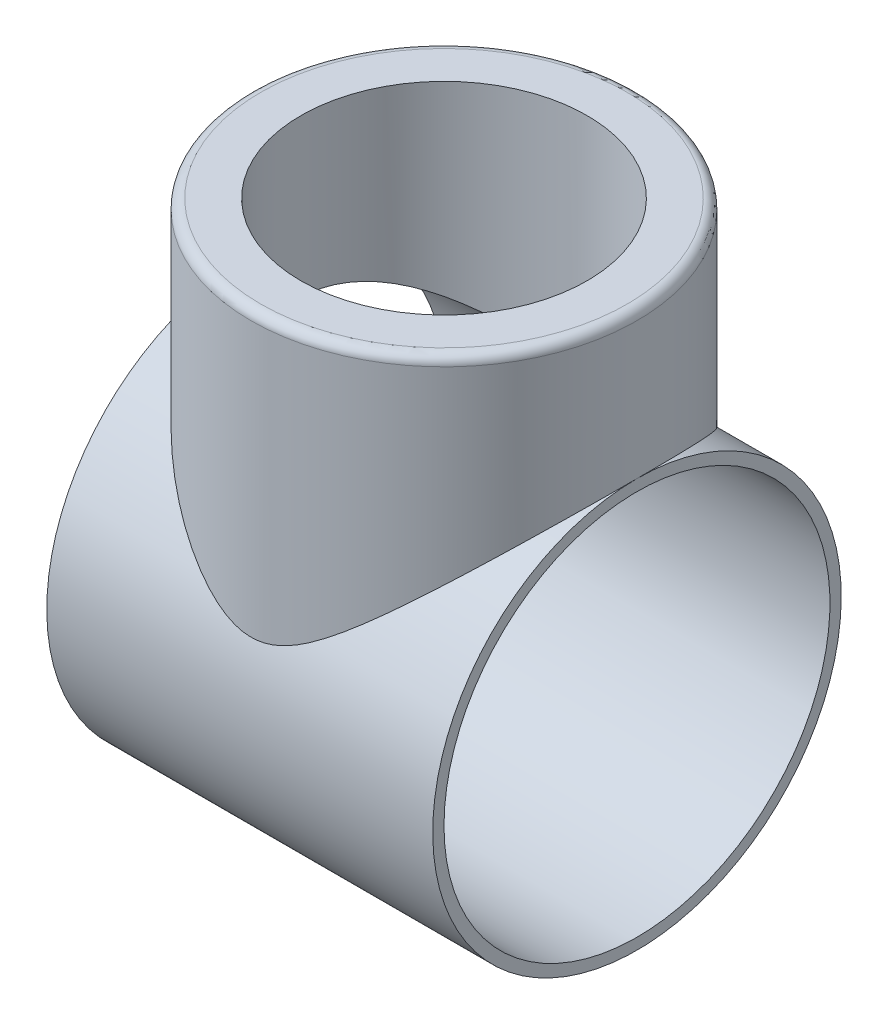
ISO-10303-21;
HEADER;
FILE_DESCRIPTION(('STEP AP214'),'2;1');
FILE_NAME('part.step','',(''),(''),'','','');
FILE_SCHEMA(('AUTOMOTIVE_DESIGN { 1 0 10303 214 1 1 1 1 }'));
ENDSEC;
DATA;
#1=APPLICATION_CONTEXT('core data for automotive mechanical design processes');
#2=APPLICATION_PROTOCOL_DEFINITION('international standard','automotive_design',2000,#1);
#3=PRODUCT_CONTEXT('',#1,'mechanical');
#4=PRODUCT('Part','Part','',(#3));
#5=PRODUCT_RELATED_PRODUCT_CATEGORY('part','',(#4));
#6=PRODUCT_DEFINITION_FORMATION('','',#4);
#7=PRODUCT_DEFINITION_CONTEXT('part definition',#1,'design');
#8=PRODUCT_DEFINITION('design','',#6,#7);
#9=PRODUCT_DEFINITION_SHAPE('','',#8);
#10=(LENGTH_UNIT() NAMED_UNIT(*) SI_UNIT(.MILLI.,.METRE.));
#11=(NAMED_UNIT(*) PLANE_ANGLE_UNIT() SI_UNIT($,.RADIAN.));
#12=(NAMED_UNIT(*) SI_UNIT($,.STERADIAN.) SOLID_ANGLE_UNIT());
#13=UNCERTAINTY_MEASURE_WITH_UNIT(LENGTH_MEASURE(1.E-05),#10,'distance_accuracy_value','');
#14=(GEOMETRIC_REPRESENTATION_CONTEXT(3) GLOBAL_UNCERTAINTY_ASSIGNED_CONTEXT((#13)) GLOBAL_UNIT_ASSIGNED_CONTEXT((#10,
#11,#12)) REPRESENTATION_CONTEXT('',''));
#15=CARTESIAN_POINT('',(0.,0.,0.));
#16=DIRECTION('',(0.,0.,1.));
#17=DIRECTION('',(1.,0.,0.));
#18=AXIS2_PLACEMENT_3D('',#15,#16,#17);
#19=CARTESIAN_POINT('',(60.,0.,0.));
#20=DIRECTION('',(-1.,0.,0.));
#21=DIRECTION('',(0.,0.,1.));
#22=AXIS2_PLACEMENT_3D('',#19,#20,#21);
#23=CYLINDRICAL_SURFACE('',#22,63.5);
#24=CARTESIAN_POINT('',(0.,20.7906228862918,-60.));
#25=CARTESIAN_POINT('',(-0.758528909390593,20.7906687322399,-59.9999904065511));
#26=CARTESIAN_POINT('',(-1.51729366262085,20.8324790088875,-59.98554699321));
#27=CARTESIAN_POINT('',(-3.02541119739764,20.9961734248151,-59.9284381571005));
#28=CARTESIAN_POINT('',(-3.7747547096643,21.1181309601118,-59.8857468656814));
#29=CARTESIAN_POINT('',(-5.26008636130047,21.4333476508569,-59.7736517022794));
#30=CARTESIAN_POINT('',(-5.99598309437329,21.6269798770012,-59.7041079787402));
#31=CARTESIAN_POINT('',(-7.44660432062502,22.0731706531462,-59.5405851678695));
#32=CARTESIAN_POINT('',(-8.16132786930634,22.3257318274139,-59.4466049922948));
#33=CARTESIAN_POINT('',(-9.4185024288943,22.8188288099899,-59.2587975120337));
#34=CARTESIAN_POINT('',(-9.96516431764429,23.0504265040595,-59.1692185698772));
#35=CARTESIAN_POINT('',(-11.0454442017346,23.5376156349974,-58.9771073554713));
#36=CARTESIAN_POINT('',(-11.5790596845841,23.793211648322,-58.8745726112687));
#37=CARTESIAN_POINT('',(-12.6342055594526,24.3241678903389,-58.6572009071734));
#38=CARTESIAN_POINT('',(-13.1557274926232,24.5995414317841,-58.5423556346522));
#39=CARTESIAN_POINT('',(-14.1871816507752,25.1662568681659,-58.3009810156804));
#40=CARTESIAN_POINT('',(-14.6971145190673,25.4575978736686,-58.1744523197619));
#41=CARTESIAN_POINT('',(-15.7078218450643,26.0541498508794,-57.9097406057808));
#42=CARTESIAN_POINT('',(-16.2085648488496,26.3593992025115,-57.7715243095543));
#43=CARTESIAN_POINT('',(-17.2002231418555,26.980521261027,-57.4840737539756));
#44=CARTESIAN_POINT('',(-17.6911376592914,27.2963947969985,-57.3348386336471));
#45=CARTESIAN_POINT('',(-19.1499499190291,28.2565531409301,-56.8710945910735));
#46=CARTESIAN_POINT('',(-20.1043443165855,28.9136328016263,-56.5404340934387));
#47=CARTESIAN_POINT('',(-22.0039769964669,30.2649996523406,-55.8290004142343));
#48=CARTESIAN_POINT('',(-22.9484730965435,30.9597983411099,-55.4472322243461));
#49=CARTESIAN_POINT('',(-24.8087273501631,32.3627900030287,-54.640232118589));
#50=CARTESIAN_POINT('',(-25.7244808693601,33.0709851069629,-54.2149932402454));
#51=CARTESIAN_POINT('',(-27.5301587030445,34.4942177445593,-53.3207838963083));
#52=CARTESIAN_POINT('',(-28.4200632243271,35.2092599917402,-52.8517810198543));
#53=CARTESIAN_POINT('',(-30.1746375527394,36.6401586498467,-51.8700459354968));
#54=CARTESIAN_POINT('',(-31.0393088329444,37.3560150107007,-51.3573162871723));
#55=CARTESIAN_POINT('',(-32.7428121268253,38.7830613774666,-50.2883478998282));
#56=CARTESIAN_POINT('',(-33.5816780939988,39.4942564530127,-49.7321700686894));
#57=CARTESIAN_POINT('',(-35.2346699825341,40.9090380230505,-48.5750536608696));
#58=CARTESIAN_POINT('',(-36.0487951337687,41.6126242802584,-47.9741136928473));
#59=CARTESIAN_POINT('',(-37.6510954118819,43.0081407004995,-46.7271330486956));
#60=CARTESIAN_POINT('',(-38.4392848277944,43.7000771756526,-46.0811178399591));
#61=CARTESIAN_POINT('',(-39.9888399141275,45.0691221589827,-44.7430488200408));
#62=CARTESIAN_POINT('',(-40.7502076319229,45.7462317974337,-44.0509985345428));
#63=CARTESIAN_POINT('',(-42.582920452239,47.3847886646906,-42.2960309164036));
#64=CARTESIAN_POINT('',(-43.6385274405875,48.3361625708875,-41.2070707142414));
#65=CARTESIAN_POINT('',(-45.6828552063846,50.1895163052427,-38.9283808789139));
#66=CARTESIAN_POINT('',(-46.6715760592438,51.0914961890899,-37.7386513593641));
#67=CARTESIAN_POINT('',(-48.0968489136663,52.397719369308,-35.8789928350596));
#68=CARTESIAN_POINT('',(-48.5620560600247,52.8251053584278,-35.2469780635363));
#69=CARTESIAN_POINT('',(-49.4722030615757,53.6629970827709,-33.9576752372916));
#70=CARTESIAN_POINT('',(-49.9171443182551,54.0735039850752,-33.3003889360367));
#71=CARTESIAN_POINT('',(-50.7852396764171,54.8758885887138,-31.9608542168824));
#72=CARTESIAN_POINT('',(-51.2084000426182,55.2677716442079,-31.2786130742795));
#73=CARTESIAN_POINT('',(-52.0316481010739,56.0314086794391,-29.8891272744112));
#74=CARTESIAN_POINT('',(-52.4317299163567,56.4031575305253,-29.1818763216913));
#75=CARTESIAN_POINT('',(-53.4326006917373,57.3344775183045,-27.3244873901495));
#76=CARTESIAN_POINT('',(-54.0148396806077,57.8775849365437,-26.1559284749152));
#77=CARTESIAN_POINT('',(-55.1104563481879,58.9013953354424,-23.7606996871457));
#78=CARTESIAN_POINT('',(-55.623849737572,59.3821125528359,-22.5340431593333));
#79=CARTESIAN_POINT('',(-56.3369569822265,60.0507779860612,-20.6542203035781));
#80=CARTESIAN_POINT('',(-56.5651646691798,60.2649336682026,-20.0209651192068));
#81=CARTESIAN_POINT('',(-57.001741284094,60.6748948739397,-18.7418762661227));
#82=CARTESIAN_POINT('',(-57.2101134658845,60.8707034071312,-18.0960446814612));
#83=CARTESIAN_POINT('',(-57.6062016973035,61.2431214762665,-16.7925461809546));
#84=CARTESIAN_POINT('',(-57.7939157959858,61.4197291988699,-16.1348781540904));
#85=CARTESIAN_POINT('',(-58.1478526247793,61.7528881498504,-14.8087211107725));
#86=CARTESIAN_POINT('',(-58.3140744128745,61.9094384991028,-14.1402316214542));
#87=CARTESIAN_POINT('',(-58.6254299614442,62.2027997497841,-12.7884212341209));
#88=CARTESIAN_POINT('',(-58.7703922744052,62.3394501114345,-12.1050259204838));
#89=CARTESIAN_POINT('',(-59.0369866822571,62.5908445998106,-10.7296289567849));
#90=CARTESIAN_POINT('',(-59.1586165304059,62.7055866169215,-10.037626484743));
#91=CARTESIAN_POINT('',(-59.3778914230342,62.9125001293602,-8.64649196407172));
#92=CARTESIAN_POINT('',(-59.475537005446,63.0046721309006,-7.94736007571117));
#93=CARTESIAN_POINT('',(-59.6463168139495,63.165911038749,-6.54346262801516));
#94=CARTESIAN_POINT('',(-59.7194513133625,63.2349782026975,-5.8386971315894));
#95=CARTESIAN_POINT('',(-59.8407758047187,63.3495702561387,-4.42541956584602));
#96=CARTESIAN_POINT('',(-59.8889765473168,63.3951052919398,-3.71690924452197));
#97=CARTESIAN_POINT('',(-59.9602033516643,63.4623971368019,-2.29757972319874));
#98=CARTESIAN_POINT('',(-59.9832322842367,63.4841566574395,-1.58676079577031));
#99=CARTESIAN_POINT('',(-60.0039892025269,63.5037692257477,-0.164433052004147));
#100=CARTESIAN_POINT('',(-60.0017179853667,63.5016230266065,0.547075741891974));
#101=CARTESIAN_POINT('',(-59.9719010196848,63.4734503428098,1.96902100026202));
#102=CARTESIAN_POINT('',(-59.9443559975306,63.4474245444525,2.679457494966));
#103=CARTESIAN_POINT('',(-59.8337650199722,63.3429462153451,4.63417148601375));
#104=CARTESIAN_POINT('',(-59.7244990534306,63.2397297181741,5.87582573496756));
#105=CARTESIAN_POINT('',(-59.4302796460327,62.9619393948515,8.34172373501795));
#106=CARTESIAN_POINT('',(-59.2453336712804,62.7873726076638,9.56596919122999));
#107=CARTESIAN_POINT('',(-58.8027968147367,62.3699728081123,11.989514771222));
#108=CARTESIAN_POINT('',(-58.5451991013245,62.1271333759116,13.1888125377168));
#109=CARTESIAN_POINT('',(-57.961305301611,61.5772140343237,15.5554813630102));
#110=CARTESIAN_POINT('',(-57.6350054065378,61.2701305633253,16.722850647674));
#111=CARTESIAN_POINT('',(-56.9088702964538,60.5875710834975,19.050065571891));
#112=CARTESIAN_POINT('',(-56.507334178709,60.2105155945908,20.2089148761407));
#113=CARTESIAN_POINT('',(-55.6419501166776,59.3991076301619,22.4822789702302));
#114=CARTESIAN_POINT('',(-55.1781030216677,58.9647559355682,23.5967943640572));
#115=CARTESIAN_POINT('',(-54.1933504392048,58.0442814595975,25.7781503739198));
#116=CARTESIAN_POINT('',(-53.6724420871035,57.5581560790584,26.8449885926275));
#117=CARTESIAN_POINT('',(-52.5785531216232,56.5394950047237,28.9288943388254));
#118=CARTESIAN_POINT('',(-52.0055613586887,56.0069493746984,29.94595113752));
#119=CARTESIAN_POINT('',(-50.9564836787026,55.0343933635614,31.6892273695647));
#120=CARTESIAN_POINT('',(-50.4903989534606,54.6030819626321,32.4263828230759));
#121=CARTESIAN_POINT('',(-49.5330968526136,53.7191212703474,33.870678097755));
#122=CARTESIAN_POINT('',(-49.0418837011452,53.2664755663289,34.5778229274382));
#123=CARTESIAN_POINT('',(-47.5326431796392,51.8791349918499,36.6548496992369));
#124=CARTESIAN_POINT('',(-46.4792485157516,50.915253822379,37.9799383317709));
#125=CARTESIAN_POINT('',(-44.2876354690731,48.9227510920271,40.5144742737073));
#126=CARTESIAN_POINT('',(-43.1491544240427,47.8939307220679,41.7235347598777));
#127=CARTESIAN_POINT('',(-40.799815617742,45.7886694310987,44.0235959738365));
#128=CARTESIAN_POINT('',(-39.5889676055662,44.712234929599,45.1146125487971));
#129=CARTESIAN_POINT('',(-37.5566358288247,42.9256357130061,46.803317434297));
#130=CARTESIAN_POINT('',(-36.7546948944416,42.225483667487,47.4355079174354));
#131=CARTESIAN_POINT('',(-35.1253194151573,40.8150874837224,48.6543643005233));
#132=CARTESIAN_POINT('',(-34.2978833639616,40.1048427505247,49.2410275034114));
#133=CARTESIAN_POINT('',(-32.6175047511009,38.6775738556822,50.3698696624441));
#134=CARTESIAN_POINT('',(-31.7645426975343,37.9605448147292,50.9120133759927));
#135=CARTESIAN_POINT('',(-30.0336692030098,36.5244804865607,51.9518821652084));
#136=CARTESIAN_POINT('',(-29.155758762104,35.8054452808009,52.4496090180162));
#137=CARTESIAN_POINT('',(-27.3763991281174,34.3720787220823,53.3998838019665));
#138=CARTESIAN_POINT('',(-26.4750155378331,33.6577400546386,53.852543505548));
#139=CARTESIAN_POINT('',(-24.6447075201963,32.2378294886631,54.7143663452147));
#140=CARTESIAN_POINT('',(-23.7157797059046,31.532258683524,55.1235241035372));
#141=CARTESIAN_POINT('',(-21.8287917760075,30.1387068647751,55.8976090636547));
#142=CARTESIAN_POINT('',(-20.8707704289992,29.4507045136316,56.2625921516717));
#143=CARTESIAN_POINT('',(-18.9203529914623,28.1021712098136,56.9481250825322));
#144=CARTESIAN_POINT('',(-17.9279688275069,27.4416308974152,57.2686901524572));
#145=CARTESIAN_POINT('',(-16.2347758220798,26.3731023134669,57.7662059172242));
#146=CARTESIAN_POINT('',(-15.5451042326865,25.9533452186927,57.9557727293178));
#147=CARTESIAN_POINT('',(-14.1450009988251,25.1397301303381,58.3133016256247));
#148=CARTESIAN_POINT('',(-13.4345684860103,24.7458732223051,58.4812628045688));
#149=CARTESIAN_POINT('',(-11.9915601861318,23.993105210065,58.794105374896));
#150=CARTESIAN_POINT('',(-11.2590148117499,23.6341487403093,58.9390168877664));
#151=CARTESIAN_POINT('',(-9.76890030891744,22.9617010121501,59.2042300029197));
#152=CARTESIAN_POINT('',(-9.01133819327823,22.6481971428826,59.3245384351665));
#153=CARTESIAN_POINT('',(-7.66394620885365,22.1517197827823,59.5113698196047));
#154=CARTESIAN_POINT('',(-7.079751872073,21.9557353810002,59.583813090906));
#155=CARTESIAN_POINT('',(-5.89778570076967,21.6036089820242,59.7123876813954));
#156=CARTESIAN_POINT('',(-5.30001891891908,21.4474524144445,59.7685249669181));
#157=CARTESIAN_POINT('',(-4.09422584327694,21.1817843970081,59.8631939386489));
#158=CARTESIAN_POINT('',(-3.48622800298982,21.0721605455251,59.9017680659426));
#159=CARTESIAN_POINT('',(-2.26220406470628,20.9045528992181,59.9604675581135));
#160=CARTESIAN_POINT('',(-1.64617858093478,20.846565176788,59.9805943261582));
#161=CARTESIAN_POINT('',(-0.406796236364823,20.7853299263222,60.0018431849288));
#162=CARTESIAN_POINT('',(0.216581931804922,20.782460444376,60.0028340260279));
#163=CARTESIAN_POINT('',(1.46078189065845,20.8326035275547,59.985442278827));
#164=CARTESIAN_POINT('',(2.08160363194154,20.8856171675315,59.9670593178927));
#165=CARTESIAN_POINT('',(3.31671831080057,21.0445852806879,59.9114546959283));
#166=CARTESIAN_POINT('',(3.93099594436183,21.1506440349662,59.8741959251749));
#167=CARTESIAN_POINT('',(5.14799615984711,21.4102311635758,59.7818607643608));
#168=CARTESIAN_POINT('',(5.75071664967074,21.5637680479414,59.7267811799951));
#169=CARTESIAN_POINT('',(7.22135694427497,21.9931303830578,59.5703433546844));
#170=CARTESIAN_POINT('',(8.08135503699847,22.2925568468197,59.459390890244));
#171=CARTESIAN_POINT('',(9.7699223088969,22.9586099987819,59.2053970578337));
#172=CARTESIAN_POINT('',(10.5984702437983,23.3252811683373,59.0623344353738));
#173=CARTESIAN_POINT('',(12.2287783127482,24.1097614729604,58.746479888434));
#174=CARTESIAN_POINT('',(13.0304255363341,24.5277583980893,58.5735777926153));
#175=CARTESIAN_POINT('',(14.6066295614521,25.4002579302589,58.2005340027037));
#176=CARTESIAN_POINT('',(15.3811908052121,25.854754510496,58.000396801882));
#177=CARTESIAN_POINT('',(17.0118428044232,26.8548428987069,57.5448468491374));
#178=CARTESIAN_POINT('',(17.8644479805038,27.404354072206,57.2856174903083));
#179=CARTESIAN_POINT('',(19.5432794738111,28.5271940338681,56.7348277230435));
#180=CARTESIAN_POINT('',(20.3694992682184,29.1005286321143,56.4432593984595));
#181=CARTESIAN_POINT('',(21.9992618422016,30.263702333972,55.8282333428868));
#182=CARTESIAN_POINT('',(22.8027836810339,30.8535557389623,55.5047473265183));
#183=CARTESIAN_POINT('',(24.3886372665537,32.043425198328,54.8264349792147));
#184=CARTESIAN_POINT('',(25.1709707940349,32.6434403917131,54.471611292834));
#185=CARTESIAN_POINT('',(26.717292217867,33.8501069518442,53.730090001806));
#186=CARTESIAN_POINT('',(27.4812507569073,34.4567669411777,53.3433452676083));
#187=CARTESIAN_POINT('',(28.9906404962926,35.6722178063828,52.5383127204356));
#188=CARTESIAN_POINT('',(29.7360714479204,36.2810087107351,52.1200244843194));
#189=CARTESIAN_POINT('',(31.2086452758761,37.4974332369506,51.2518358260863));
#190=CARTESIAN_POINT('',(31.9357955085429,38.1050672303483,50.8019484055167));
#191=CARTESIAN_POINT('',(33.3722766591619,39.3167920231316,49.8700720854739));
#192=CARTESIAN_POINT('',(34.0816073882601,39.9208827849134,49.3880828459778));
#193=CARTESIAN_POINT('',(35.5621292038822,41.1916832002392,48.334788391454));
#194=CARTESIAN_POINT('',(36.3311519208352,41.8576791485037,47.7595654971654));
#195=CARTESIAN_POINT('',(37.8461742604986,43.1792288351406,46.5681837635289));
#196=CARTESIAN_POINT('',(38.592173420413,43.8347823634822,45.9520241020961));
#197=CARTESIAN_POINT('',(40.0603124376435,45.1327034482771,44.6779183477357));
#198=CARTESIAN_POINT('',(40.7824432065482,45.7750659474894,44.0199566101734));
#199=CARTESIAN_POINT('',(42.2010533624282,47.0433627335258,42.6618713423327));
#200=CARTESIAN_POINT('',(42.8975331462099,47.6692972744383,41.9617484647056));
#201=CARTESIAN_POINT('',(44.2609049256131,48.8998143820475,40.521017507327));
#202=CARTESIAN_POINT('',(44.9278811753658,49.5044565887797,39.7805402872029));
#203=CARTESIAN_POINT('',(46.2323436227259,50.6912847640406,38.2567162942636));
#204=CARTESIAN_POINT('',(46.8698286547506,51.2734698448444,37.4733678297129));
#205=CARTESIAN_POINT('',(48.1123681622241,52.4117157514378,35.8640870505328));
#206=CARTESIAN_POINT('',(48.717442060897,52.9677921982709,35.0381808354607));
#207=CARTESIAN_POINT('',(49.8925851930704,54.0506056360253,33.3435603311625));
#208=CARTESIAN_POINT('',(50.462659611206,54.5773469714134,32.4748524168838));
#209=CARTESIAN_POINT('',(51.699934053744,55.7231195826796,30.4764801174487));
#210=CARTESIAN_POINT('',(52.356664408651,56.3331017236957,29.3350678509571));
#211=CARTESIAN_POINT('',(53.6041104557305,57.4943370151524,26.9882327473558));
#212=CARTESIAN_POINT('',(54.1948377861363,58.0456005185766,25.7828212506258));
#213=CARTESIAN_POINT('',(55.3028391398837,59.0814298893704,23.3115648644225));
#214=CARTESIAN_POINT('',(55.8201400017101,59.5660201248309,22.0457422833466));
#215=CARTESIAN_POINT('',(56.7739730326629,60.4607864226878,19.4580612763679));
#216=CARTESIAN_POINT('',(57.2105026371028,60.8709601221679,18.13620107277));
#217=CARTESIAN_POINT('',(57.8007267910454,61.4261308181703,16.1113950707763));
#218=CARTESIAN_POINT('',(57.9874127712146,61.6018391117937,15.4262120958626));
#219=CARTESIAN_POINT('',(58.3374041299347,61.9314075349646,14.044739245825));
#220=CARTESIAN_POINT('',(58.5007123385065,62.0852703090263,13.3484507264558));
#221=CARTESIAN_POINT('',(58.8031402422415,62.3703194822201,11.9459393581315));
#222=CARTESIAN_POINT('',(58.9422563834057,62.5015025495142,11.2397150659803));
#223=CARTESIAN_POINT('',(59.1955130783151,62.740393688889,9.81895124098024));
#224=CARTESIAN_POINT('',(59.3096568654099,62.848104800045,9.10441279725668));
#225=CARTESIAN_POINT('',(59.5122928987245,63.0393677528274,7.66890692232703));
#226=CARTESIAN_POINT('',(59.6007995008431,63.1229331151367,6.94794332303366));
#227=CARTESIAN_POINT('',(59.7517239443748,63.2654558007023,5.50095812532421));
#228=CARTESIAN_POINT('',(59.8141451118529,63.3244162612443,4.77493718376181));
#229=CARTESIAN_POINT('',(59.9125411076332,63.4173660881438,3.3195428430593));
#230=CARTESIAN_POINT('',(59.948517092367,63.4513565464241,2.59016959191732));
#231=CARTESIAN_POINT('',(59.9938077638634,63.4941486592253,1.12987181716054));
#232=CARTESIAN_POINT('',(60.0031233492999,63.5029511627869,0.398947346665709));
#233=CARTESIAN_POINT('',(59.9955648266932,63.4958093154703,-0.967958496529033));
#234=CARTESIAN_POINT('',(59.9819259055394,63.4829219168062,-1.60397782434463));
#235=CARTESIAN_POINT('',(59.9344696401623,63.4380847001962,-2.87464688972434));
#236=CARTESIAN_POINT('',(59.9006505868162,63.4061332676538,-3.50929650671339));
#237=CARTESIAN_POINT('',(59.8129923027163,63.3233277660118,-4.7758532298756));
#238=CARTESIAN_POINT('',(59.7591570784979,63.2724774798005,-5.40776085930742));
#239=CARTESIAN_POINT('',(59.6317156906658,63.1521265361284,-6.66781363904785));
#240=CARTESIAN_POINT('',(59.5581075644902,63.0826240273394,-7.29595840954312));
#241=CARTESIAN_POINT('',(59.3080827836328,62.8466036531324,-9.17297148526001));
#242=CARTESIAN_POINT('',(59.1024447948381,62.6525531478351,-10.4147182262869));
#243=CARTESIAN_POINT('',(58.6167591889884,62.1945973466313,-12.8702342859528));
#244=CARTESIAN_POINT('',(58.3367086016047,61.9306892622204,-14.0840024856697));
#245=CARTESIAN_POINT('',(57.7100015478256,61.3407142955875,-16.4636856187242));
#246=CARTESIAN_POINT('',(57.3641083663048,61.0153600426409,-17.629979120163));
#247=CARTESIAN_POINT('',(56.6085536781709,60.3055684631368,-19.9230807615388));
#248=CARTESIAN_POINT('',(56.1988947678093,59.9211335420844,-21.0498905067879));
#249=CARTESIAN_POINT('',(55.3207434138154,59.0983173899384,-23.2600440438989));
#250=CARTESIAN_POINT('',(54.8522455668946,58.6599312044746,-24.3433838317628));
#251=CARTESIAN_POINT('',(53.8612856691139,57.7343636462476,-26.4637822601105));
#252=CARTESIAN_POINT('',(53.3388122451557,57.2471719904282,-27.5008310805132));
#253=CARTESIAN_POINT('',(52.3889698406636,56.3633957674971,-29.2594364245282));
#254=CARTESIAN_POINT('',(51.9728151953929,55.9767610641627,-29.9921232903098));
#255=CARTESIAN_POINT('',(51.1157596421067,55.1819284837637,-31.4305576832215));
#256=CARTESIAN_POINT('',(50.6748631796574,54.7737344812064,-32.1363100118582));
#257=CARTESIAN_POINT('',(49.3170999662078,53.5192123515484,-34.2134573931227));
#258=CARTESIAN_POINT('',(48.365333821438,52.6431066845712,-35.544422271004));
#259=CARTESIAN_POINT('',(46.3788184091041,50.8240590270626,-38.1003035628411));
#260=CARTESIAN_POINT('',(45.3438610810191,49.880950191552,-39.3249370792602));
#261=CARTESIAN_POINT('',(43.2027194272394,47.9428552948351,-41.6658221487646));
#262=CARTESIAN_POINT('',(42.0965390556093,46.947872114101,-42.7820797099057));
#263=CARTESIAN_POINT('',(40.2064302868388,45.2624736428015,-44.5477544674519));
#264=CARTESIAN_POINT('',(39.4403564109536,44.5831323145074,-45.2271663401913));
#265=CARTESIAN_POINT('',(37.881847787335,43.2105078996867,-46.5403482710392));
#266=CARTESIAN_POINT('',(37.0894112467148,42.5172238662102,-47.1741152155873));
#267=CARTESIAN_POINT('',(35.4789521738248,41.1198933091534,-48.3969715779152));
#268=CARTESIAN_POINT('',(34.6609153926954,40.4158409075946,-48.9860354664779));
#269=CARTESIAN_POINT('',(33.0003075284587,39.0010407184266,-50.1197610987062));
#270=CARTESIAN_POINT('',(32.1577372210999,38.2902931429982,-50.6644242442557));
#271=CARTESIAN_POINT('',(30.4490729831919,36.8669598937637,-51.7093385919693));
#272=CARTESIAN_POINT('',(29.5830080569936,36.1543773886613,-52.2096415656976));
#273=CARTESIAN_POINT('',(27.8256581519399,34.7311285759401,-53.1670401249723));
#274=CARTESIAN_POINT('',(26.9343714604259,34.0204624020541,-53.6241327671729));
#275=CARTESIAN_POINT('',(25.1258248252375,32.6073398840304,-54.4949495594718));
#276=CARTESIAN_POINT('',(24.2085864568005,31.9048773685258,-54.9087084637163));
#277=CARTESIAN_POINT('',(22.344975564338,30.5149443004884,-55.6931263449375));
#278=CARTESIAN_POINT('',(21.3986087449945,29.8274708569014,-56.0637936941325));
#279=CARTESIAN_POINT('',(19.6756130564587,28.6196883457188,-56.6879471908933));
#280=CARTESIAN_POINT('',(18.9052559185584,28.0946895717879,-56.9496640726385));
#281=CARTESIAN_POINT('',(17.341021107444,27.0668241712747,-57.4452982374672));
#282=CARTESIAN_POINT('',(16.5471427806282,26.5639581606797,-57.6792147471333));
#283=CARTESIAN_POINT('',(14.933113310896,25.5897236238591,-58.1179936672118));
#284=CARTESIAN_POINT('',(14.1129804471928,25.1183338593668,-58.3228757752122));
#285=CARTESIAN_POINT('',(12.4422523256131,24.2190798118308,-58.7019917209436));
#286=CARTESIAN_POINT('',(11.5916668925529,23.7912016588509,-58.8762353381179));
#287=CARTESIAN_POINT('',(10.1079983535897,23.1110901117272,-59.1457542845923));
#288=CARTESIAN_POINT('',(9.48330374745795,22.8438858827683,-59.2492821337488));
#289=CARTESIAN_POINT('',(8.21602229594292,22.3475529356675,-59.4382650546879));
#290=CARTESIAN_POINT('',(7.57343358899561,22.1184281964295,-59.5237182381131));
#291=CARTESIAN_POINT('',(6.27313840663821,21.7076776101192,-59.6747400129474));
#292=CARTESIAN_POINT('',(5.61548874890345,21.5258976752117,-59.7403732243001));
#293=CARTESIAN_POINT('',(4.2857853782639,21.2179349544761,-59.850449047694));
#294=CARTESIAN_POINT('',(3.61374296616364,21.0917101136825,-59.894907690893));
#295=CARTESIAN_POINT('',(2.45075155215774,20.9290297879869,-59.9519040948818));
#296=CARTESIAN_POINT('',(1.96218341195357,20.8772967138731,-59.969908212552));
#297=CARTESIAN_POINT('',(0.982442747121063,20.8080822970911,-59.9939579169726));
#298=CARTESIAN_POINT('',(0.491270837902514,20.7905931935839,-60.0000062133185));
#299=CARTESIAN_POINT('',(0.,20.7906228862918,-60.));
#300=B_SPLINE_CURVE_WITH_KNOTS('',3,(#24,#25,#26,#27,#28,#29,#30,#31,#32,#33,#34,#35,#36,#37,
#38,#39,#40,#41,#42,#43,#44,#45,#46,#47,#48,#49,#50,#51,#52,#53,#54,#55,#56,#57,#58,#59,#60,#61,
#62,#63,#64,#65,#66,#67,#68,#69,#70,#71,#72,#73,#74,#75,#76,#77,#78,#79,#80,#81,#82,#83,#84,#85,
#86,#87,#88,#89,#90,#91,#92,#93,#94,#95,#96,#97,#98,#99,#100,#101,#102,#103,#104,#105,#106,#107,
#108,#109,#110,#111,#112,#113,#114,#115,#116,#117,#118,#119,#120,#121,#122,#123,#124,#125,#126,
#127,#128,#129,#130,#131,#132,#133,#134,#135,#136,#137,#138,#139,#140,#141,#142,#143,#144,#145,
#146,#147,#148,#149,#150,#151,#152,#153,#154,#155,#156,#157,#158,#159,#160,#161,#162,#163,#164,
#165,#166,#167,#168,#169,#170,#171,#172,#173,#174,#175,#176,#177,#178,#179,#180,#181,#182,#183,
#184,#185,#186,#187,#188,#189,#190,#191,#192,#193,#194,#195,#196,#197,#198,#199,#200,#201,#202,
#203,#204,#205,#206,#207,#208,#209,#210,#211,#212,#213,#214,#215,#216,#217,#218,#219,#220,#221,
#222,#223,#224,#225,#226,#227,#228,#229,#230,#231,#232,#233,#234,#235,#236,#237,#238,#239,#240,
#241,#242,#243,#244,#245,#246,#247,#248,#249,#250,#251,#252,#253,#254,#255,#256,#257,#258,#259,
#260,#261,#262,#263,#264,#265,#266,#267,#268,#269,#270,#271,#272,#273,#274,#275,#276,#277,#278,
#279,#280,#281,#282,#283,#284,#285,#286,#287,#288,#289,#290,#291,#292,#293,#294,#295,#296,#297,
#298,#299),.UNSPECIFIED.,.T.,.F.,(4,2,2,2,2,2,2,2,2,2,2,2,2,2,2,2,2,2,2,2,2,2,2,2,2,2,2,2,2,2,2,
2,2,2,2,2,2,2,2,2,2,2,2,2,2,2,2,2,2,2,2,2,2,2,2,2,2,2,2,2,2,2,2,2,2,2,2,2,2,2,2,2,2,2,2,2,2,2,2,
2,2,2,2,2,2,2,2,2,2,2,2,2,2,2,2,2,2,2,2,2,2,2,2,2,2,2,2,2,2,2,2,2,2,2,2,2,2,2,2,2,2,2,2,2,2,2,2,
2,2,2,2,2,2,2,2,2,2,4),(0.,2.27477774704132,4.55164156316737,6.84052715918305,9.12951470498149,
10.9299653278367,12.7307599949467,14.5327783931341,16.3346965154922,18.1419301359971,
19.9493051178018,23.5625217403692,27.2606455575169,30.9593626147631,34.6608409531296,
38.3621027712236,42.0582660022256,45.754544169034,49.4487505998251,53.1426744278283,
58.5091514388793,63.8756223994084,66.5558000731325,69.2357921169974,71.91500897189,
74.5949051066864,78.8329239125444,83.0699739440415,85.188550132823,87.3067781878718,
89.4252061166788,91.5437268654982,93.6784898296907,95.8134582525359,97.9483787867686,
100.083275513858,102.217250971486,104.350983025671,106.484647853367,108.618251361579,
112.365518325055,116.112415696307,119.859665515014,123.607123131763,127.452648797824,
131.298122056043,135.143788457244,138.990280052231,141.908148029823,144.825527109784,
150.661781341374,156.516862108459,162.371155864151,166.084548874822,169.798161701307,
173.514686519645,177.231062571243,180.937979062561,184.64535327583,188.347987074659,
192.049348404751,194.536567455358,197.02389068574,199.507936272764,201.991291334797,
203.8512173347,205.710461930832,207.565189531834,209.419776044377,211.287078324015,
213.154416519865,215.025440220571,216.896799480283,219.644109709103,222.393243840262,
225.152754221251,227.911809886529,231.05132104812,234.191602423453,237.334692139589,
240.477516866525,243.625067768735,246.772660901368,249.918966452536,253.065305334708,
256.57038947819,260.07554403144,263.582018223236,267.088438149023,270.584095599558,
274.079891091284,277.573567643488,281.066725406221,285.416601887301,289.765710145426,
294.113224622399,298.460877119986,300.654950854023,302.848758757122,305.042888675546,
307.236734335897,309.42934913642,311.621684278741,313.813923545885,316.00608891572,
317.91438304262,319.822838812258,321.730912781474,323.639176206849,327.454802885108,
331.270581894679,335.044558623878,338.818381734027,342.592551655092,346.367518453135,
349.147826516555,351.927636608743,357.48845106494,363.063633748737,368.638507183512,
372.323829803421,376.009403571223,379.697066516227,383.384612983916,387.067797555696,
390.751232833408,394.431690960174,398.111432814836,401.015499058924,403.919646076397,
406.821813325436,409.72305254886,411.78366986526,413.844502359189,415.898541425653,
417.951022907821,419.424645485933,420.897934052784),.UNSPECIFIED.);
#301=CARTESIAN_POINT('',(-60.,63.5,0.));
#302=VERTEX_POINT('',#301);
#303=CARTESIAN_POINT('',(60.,63.5,0.));
#304=VERTEX_POINT('',#303);
#305=EDGE_CURVE('E46',#302,#304,#300,.T.);
#306=ORIENTED_EDGE('',*,*,#305,.F.);
#307=CARTESIAN_POINT('',(-60.,0.,0.));
#308=DIRECTION('',(-1.,0.,0.));
#309=DIRECTION('',(0.,0.,1.));
#310=AXIS2_PLACEMENT_3D('',#307,#308,#309);
#311=CIRCLE('',#310,63.5);
#312=EDGE_CURVE('E52',#302,#302,#311,.T.);
#313=ORIENTED_EDGE('',*,*,#312,.F.);
#314=EDGE_CURVE('E55',#304,#302,#300,.T.);
#315=ORIENTED_EDGE('',*,*,#314,.F.);
#316=CARTESIAN_POINT('',(60.,0.,0.));
#317=DIRECTION('',(-1.,0.,0.));
#318=DIRECTION('',(0.,0.,1.));
#319=AXIS2_PLACEMENT_3D('',#316,#317,#318);
#320=CIRCLE('',#319,63.5);
#321=EDGE_CURVE('E54',#304,#304,#320,.T.);
#322=ORIENTED_EDGE('',*,*,#321,.T.);
#323=EDGE_LOOP('',(#306,#313,#315,#322));
#324=FACE_BOUND('',#323,.T.);
#325=ADVANCED_FACE('F32',(#324),#23,.T.);
#326=CARTESIAN_POINT('',(60.,63.5,0.));
#327=DIRECTION('',(1.,0.,0.));
#328=DIRECTION('',(0.,0.,-1.));
#329=AXIS2_PLACEMENT_3D('',#326,#327,#328);
#330=PLANE('',#329);
#331=CARTESIAN_POINT('',(60.,0.,0.));
#332=DIRECTION('',(-1.,0.,0.));
#333=DIRECTION('',(0.,0.,1.));
#334=AXIS2_PLACEMENT_3D('',#331,#332,#333);
#335=CIRCLE('',#334,60.);
#336=CARTESIAN_POINT('',(60.,0.,60.));
#337=VERTEX_POINT('',#336);
#338=EDGE_CURVE('E113',#337,#337,#335,.T.);
#339=ORIENTED_EDGE('',*,*,#338,.T.);
#340=EDGE_LOOP('',(#339));
#341=FACE_BOUND('',#340,.T.);
#342=ORIENTED_EDGE('',*,*,#321,.F.);
#343=EDGE_LOOP('',(#342));
#344=FACE_BOUND('',#343,.T.);
#345=ADVANCED_FACE('F81',(#341,#344),#330,.T.);
#346=CARTESIAN_POINT('',(-60.,0.,0.));
#347=DIRECTION('',(-1.,0.,0.));
#348=DIRECTION('',(0.,0.,1.));
#349=AXIS2_PLACEMENT_3D('',#346,#347,#348);
#350=PLANE('',#349);
#351=CARTESIAN_POINT('',(-60.,0.,0.));
#352=DIRECTION('',(-1.,0.,0.));
#353=DIRECTION('',(0.,0.,1.));
#354=AXIS2_PLACEMENT_3D('',#351,#352,#353);
#355=CIRCLE('',#354,60.);
#356=CARTESIAN_POINT('',(-60.,0.,60.));
#357=VERTEX_POINT('',#356);
#358=EDGE_CURVE('E110',#357,#357,#355,.T.);
#359=ORIENTED_EDGE('',*,*,#358,.F.);
#360=EDGE_LOOP('',(#359));
#361=FACE_BOUND('',#360,.T.);
#362=ORIENTED_EDGE('',*,*,#312,.T.);
#363=EDGE_LOOP('',(#362));
#364=FACE_BOUND('',#363,.T.);
#365=ADVANCED_FACE('F58',(#361,#364),#350,.T.);
#366=CARTESIAN_POINT('',(0.,109.,0.));
#367=DIRECTION('',(0.,-1.,0.));
#368=DIRECTION('',(0.,0.,-1.));
#369=AXIS2_PLACEMENT_3D('',#366,#367,#368);
#370=CYLINDRICAL_SURFACE('',#369,60.);
#371=CARTESIAN_POINT('',(0.,106.,0.));
#372=DIRECTION('',(0.,1.,0.));
#373=DIRECTION('',(0.,0.,1.));
#374=AXIS2_PLACEMENT_3D('',#371,#372,#373);
#375=CIRCLE('',#374,60.);
#376=CARTESIAN_POINT('',(0.,106.,60.));
#377=VERTEX_POINT('',#376);
#378=EDGE_CURVE('E40',#377,#377,#375,.F.);
#379=ORIENTED_EDGE('',*,*,#378,.T.);
#380=EDGE_LOOP('',(#379));
#381=FACE_BOUND('',#380,.T.);
#382=ORIENTED_EDGE('',*,*,#314,.T.);
#383=ORIENTED_EDGE('',*,*,#305,.T.);
#384=EDGE_LOOP('',(#382,#383));
#385=FACE_BOUND('',#384,.T.);
#386=ADVANCED_FACE('F68',(#381,#385),#370,.T.);
#387=CARTESIAN_POINT('',(60.,109.,0.));
#388=DIRECTION('',(0.,1.,0.));
#389=DIRECTION('',(0.,0.,1.));
#390=AXIS2_PLACEMENT_3D('',#387,#388,#389);
#391=PLANE('',#390);
#392=CARTESIAN_POINT('',(0.,109.,0.));
#393=DIRECTION('',(0.,1.,0.));
#394=DIRECTION('',(0.,0.,1.));
#395=AXIS2_PLACEMENT_3D('',#392,#393,#394);
#396=CIRCLE('',#395,57.);
#397=CARTESIAN_POINT('',(0.,109.,57.));
#398=VERTEX_POINT('',#397);
#399=EDGE_CURVE('E11',#398,#398,#396,.T.);
#400=ORIENTED_EDGE('',*,*,#399,.T.);
#401=EDGE_LOOP('',(#400));
#402=FACE_BOUND('',#401,.T.);
#403=CARTESIAN_POINT('',(0.,109.,0.));
#404=DIRECTION('',(0.,1.,0.));
#405=DIRECTION('',(0.,0.,1.));
#406=AXIS2_PLACEMENT_3D('',#403,#404,#405);
#407=CIRCLE('',#406,44.5);
#408=CARTESIAN_POINT('',(0.,109.,44.5));
#409=VERTEX_POINT('',#408);
#410=EDGE_CURVE('E111',#409,#409,#407,.T.);
#411=ORIENTED_EDGE('',*,*,#410,.F.);
#412=EDGE_LOOP('',(#411));
#413=FACE_BOUND('',#412,.T.);
#414=ADVANCED_FACE('F94',(#402,#413),#391,.T.);
#415=CARTESIAN_POINT('',(-60.,0.,0.));
#416=DIRECTION('',(-1.,0.,0.));
#417=DIRECTION('',(0.,0.,1.));
#418=AXIS2_PLACEMENT_3D('',#415,#416,#417);
#419=CYLINDRICAL_SURFACE('',#418,60.);
#420=CARTESIAN_POINT('',(0.,40.2461178252015,44.5));
#421=CARTESIAN_POINT('',(0.521950340710103,40.2461091874401,44.5000042882494));
#422=CARTESIAN_POINT('',(1.04383948497891,40.2562813467974,44.4908134860221));
#423=CARTESIAN_POINT('',(2.08624468800878,40.29679076695,44.4541277588759));
#424=CARTESIAN_POINT('',(2.60676066855393,40.3271291525427,44.4266318129637));
#425=CARTESIAN_POINT('',(3.64504853630486,40.4075295655595,44.353517329002));
#426=CARTESIAN_POINT('',(4.162820072278,40.4575940585679,44.3078965255041));
#427=CARTESIAN_POINT('',(5.19431452475009,40.5766947814115,44.1988491619565));
#428=CARTESIAN_POINT('',(5.70803686242041,40.6457336747779,44.1354201020462));
#429=CARTESIAN_POINT('',(7.24359513295137,40.8802693471307,43.9186705620038));
#430=CARTESIAN_POINT('',(8.25776608674281,41.0730198952663,43.7390345051422));
#431=CARTESIAN_POINT('',(10.257564643931,41.5212745320888,43.3137226483211));
#432=CARTESIAN_POINT('',(11.2431912015059,41.7767809168074,43.068044432063));
#433=CARTESIAN_POINT('',(13.1683910438996,42.3357936145266,42.5186066248349));
#434=CARTESIAN_POINT('',(14.1084079437203,42.6386010337178,42.2156810096681));
#435=CARTESIAN_POINT('',(15.9539269275721,43.2842945061566,41.5533826240879));
#436=CARTESIAN_POINT('',(16.8594298899541,43.6271795385581,41.1940112913641));
#437=CARTESIAN_POINT('',(18.6345171116782,44.3433852758226,40.4220393745185));
#438=CARTESIAN_POINT('',(19.5041118289542,44.7166970236495,40.0094544347709));
#439=CARTESIAN_POINT('',(21.2071478906121,45.4853354810806,39.1334121551077));
#440=CARTESIAN_POINT('',(22.0405865870086,45.8806637983028,38.6699510978861));
#441=CARTESIAN_POINT('',(23.8366942513597,46.767617311318,37.5948011891203));
#442=CARTESIAN_POINT('',(24.7912022086411,47.2624844601025,36.9721303467494));
#443=CARTESIAN_POINT('',(26.6465675245206,48.261565680328,35.6581377576236));
#444=CARTESIAN_POINT('',(27.5474205383753,48.7657805043798,34.9668104634264));
#445=CARTESIAN_POINT('',(29.2952372557201,49.7739969690618,33.5161235927462));
#446=CARTESIAN_POINT('',(30.1421256550589,50.2779973773472,32.756672361943));
#447=CARTESIAN_POINT('',(31.778415864999,51.2757000550551,31.1717762181585));
#448=CARTESIAN_POINT('',(32.5678130326399,51.7694014904457,30.3463259864019));
#449=CARTESIAN_POINT('',(34.2360957924211,52.8334127397948,28.4608944512654));
#450=CARTESIAN_POINT('',(35.1017938682631,53.3995579491808,27.3868198685674));
#451=CARTESIAN_POINT('',(36.7388816469887,54.4896567975256,25.1480955787368));
#452=CARTESIAN_POINT('',(37.5102508272926,55.0136012466809,23.9834262512978));
#453=CARTESIAN_POINT('',(38.5884296851264,55.7561611927072,22.1737546625714));
#454=CARTESIAN_POINT('',(38.9344445874246,55.9962895928251,21.5605741567995));
#455=CARTESIAN_POINT('',(39.5992657729467,56.4605628572466,20.3137179214327));
#456=CARTESIAN_POINT('',(39.9180737273749,56.6847087031498,19.6800434539945));
#457=CARTESIAN_POINT('',(40.5269396885394,57.1151163559301,18.3935670488333));
#458=CARTESIAN_POINT('',(40.8170136671901,57.3213880901394,17.7407760015974));
#459=CARTESIAN_POINT('',(41.3672838935259,57.7145139820236,16.4168180955821));
#460=CARTESIAN_POINT('',(41.6274729718284,57.9013634792897,15.7456468750289));
#461=CARTESIAN_POINT('',(42.2160536104265,58.3257078564334,14.1098261539199));
#462=CARTESIAN_POINT('',(42.5291096534308,58.5528683078576,13.1368990351965));
#463=CARTESIAN_POINT('',(43.0893465453492,58.9610459401474,11.1628943464203));
#464=CARTESIAN_POINT('',(43.336542803193,59.1420739139977,10.1618234217544));
#465=CARTESIAN_POINT('',(43.6554372000947,59.3762755689208,8.64408717725168));
#466=CARTESIAN_POINT('',(43.7530730054295,59.4481102596546,8.13557560487837));
#467=CARTESIAN_POINT('',(43.9307501982228,59.5789994743003,7.11392105689514));
#468=CARTESIAN_POINT('',(44.0107948440873,59.6380563650094,6.60077895735987));
#469=CARTESIAN_POINT('',(44.1530120978249,59.7430847523843,5.57062792558039));
#470=CARTESIAN_POINT('',(44.2151826797549,59.7890547657069,5.05361856180834));
#471=CARTESIAN_POINT('',(44.3214117367221,59.8676564997752,4.01674246446688));
#472=CARTESIAN_POINT('',(44.3654693389796,59.9002875777797,3.49687559443047));
#473=CARTESIAN_POINT('',(44.4703501236668,59.9779923563319,1.93186704400709));
#474=CARTESIAN_POINT('',(44.5035602840376,60.0026399674937,0.883636029687556));
#475=CARTESIAN_POINT('',(44.4958330595715,59.9969100963708,-1.21224592845824));
#476=CARTESIAN_POINT('',(44.4548959647422,59.9665328293014,-2.25989687453726));
#477=CARTESIAN_POINT('',(44.2995376296407,59.8514519760434,-4.34695695359887));
#478=CARTESIAN_POINT('',(44.1851013218437,59.7667372505429,-5.38636435239262));
#479=CARTESIAN_POINT('',(43.8844904701221,59.5448422310987,-7.44901649884122));
#480=CARTESIAN_POINT('',(43.6983163060761,59.4076622149782,-8.47226133205296));
#481=CARTESIAN_POINT('',(43.2641008547635,59.0890127256266,-10.4628678346911));
#482=CARTESIAN_POINT('',(43.01826041709,58.9091228962178,-11.4309658277477));
#483=CARTESIAN_POINT('',(42.4650233393857,58.5063437246237,-13.3401503805874));
#484=CARTESIAN_POINT('',(42.1576284675576,58.2834556176068,-14.2812377153867));
#485=CARTESIAN_POINT('',(41.4846675568433,57.7985571326788,-16.1320211676758));
#486=CARTESIAN_POINT('',(41.1190966396066,57.5365434740096,-17.0417146448432));
#487=CARTESIAN_POINT('',(40.3333455968535,56.9776492982644,-18.8260933971559));
#488=CARTESIAN_POINT('',(39.9131622370173,56.6807667162419,-19.7007765948666));
#489=CARTESIAN_POINT('',(38.9730054588369,56.0224995577731,-21.5058204330082));
#490=CARTESIAN_POINT('',(38.4471458754559,55.6576115664077,-22.4318370619908));
#491=CARTESIAN_POINT('',(37.3370135215526,54.8966231580356,-24.2346518194598));
#492=CARTESIAN_POINT('',(36.7527371551883,54.5005208199496,-25.1114469129235));
#493=CARTESIAN_POINT('',(35.5293085248845,53.6830922067384,-26.8145183935474));
#494=CARTESIAN_POINT('',(34.8901161360653,53.2617475573134,-27.6407570734165));
#495=CARTESIAN_POINT('',(33.5606121215878,52.4004604406604,-29.2406792745826));
#496=CARTESIAN_POINT('',(32.870298061972,51.9605170883568,-30.0143602901862));
#497=CARTESIAN_POINT('',(31.3024484369484,50.9818427894828,-31.6532889949493));
#498=CARTESIAN_POINT('',(30.4145893453604,50.4405197225372,-32.5071389666396));
#499=CARTESIAN_POINT('',(28.5731712452283,49.3520446269879,-34.1370213226318));
#500=CARTESIAN_POINT('',(27.6195994067465,48.8048914778322,-34.9130384375959));
#501=CARTESIAN_POINT('',(25.6486318538073,47.7171498458324,-36.3855978659591));
#502=CARTESIAN_POINT('',(24.6312091197478,47.176564259242,-37.0821061775823));
#503=CARTESIAN_POINT('',(22.5342509045027,46.116418432799,-38.3925212205582));
#504=CARTESIAN_POINT('',(21.4547302842137,45.5968532127562,-39.006447598487));
#505=CARTESIAN_POINT('',(19.4624345702153,44.6980671169939,-40.0305783513116));
#506=CARTESIAN_POINT('',(18.5609538061182,44.3119394783666,-40.456726223778));
#507=CARTESIAN_POINT('',(16.7197604126816,43.572807752645,-41.2517262412505));
#508=CARTESIAN_POINT('',(15.7800487337205,43.2198028428767,-41.6205798094328));
#509=CARTESIAN_POINT('',(13.8656151236315,42.5581977274057,-42.296847572139));
#510=CARTESIAN_POINT('',(12.8909619150813,42.249515755869,-42.6043753175112));
#511=CARTESIAN_POINT('',(10.9079654832495,41.6872994375876,-43.1546536827896));
#512=CARTESIAN_POINT('',(9.89963037601219,41.4337519145739,-43.3974197828659));
#513=CARTESIAN_POINT('',(8.04368455823552,41.0339903275956,-43.7752515698321));
#514=CARTESIAN_POINT('',(7.20084207288905,40.8765977494339,-43.9219324868934));
#515=CARTESIAN_POINT('',(5.50041819802817,40.6115732475786,-44.1671019477012));
#516=CARTESIAN_POINT('',(4.64283865424272,40.5039351388694,-44.2655964816223));
#517=CARTESIAN_POINT('',(2.91911830773346,40.3427295547647,-44.4125677286822));
#518=CARTESIAN_POINT('',(2.05298633650208,40.2891112096413,-44.4610914996129));
#519=CARTESIAN_POINT('',(0.317674362642969,40.2380272726962,-44.5073296836803));
#520=CARTESIAN_POINT('',(-0.551505685991477,40.2405625321183,-44.505043326576));
#521=CARTESIAN_POINT('',(-2.28596227436671,40.3016700196147,-44.4497135761221));
#522=CARTESIAN_POINT('',(-3.15123997960498,40.3602242255133,-44.3966865068562));
#523=CARTESIAN_POINT('',(-4.87190451576457,40.5308806498048,-44.240941803076));
#524=CARTESIAN_POINT('',(-5.72729134396147,40.642982882947,-44.1382241548748));
#525=CARTESIAN_POINT('',(-7.42406538769414,40.9165547676885,-43.8847377234221));
#526=CARTESIAN_POINT('',(-8.2654315012381,41.0780927929654,-43.7339023771943));
#527=CARTESIAN_POINT('',(-9.92893795590826,41.4448438963211,-43.3865023518875));
#528=CARTESIAN_POINT('',(-10.7510755777273,41.6500631108678,-43.1899312473468));
#529=CARTESIAN_POINT('',(-12.6870807095659,42.1846332622748,-42.6690124944642));
#530=CARTESIAN_POINT('',(-13.79081796446,42.5312978618984,-42.3246484503561));
#531=CARTESIAN_POINT('',(-15.951614460735,43.2801948728189,-41.5585305214342));
#532=CARTESIAN_POINT('',(-17.0086544471687,43.6824499289663,-41.1367450758049));
#533=CARTESIAN_POINT('',(-19.0755684632274,44.527930076714,-40.2200546403791));
#534=CARTESIAN_POINT('',(-20.0853647652595,44.9712193419745,-39.7250343695754));
#535=CARTESIAN_POINT('',(-22.0550882608732,45.8848084243981,-38.6661782679115));
#536=CARTESIAN_POINT('',(-23.0150204412288,46.3551055306381,-38.1023493373789));
#537=CARTESIAN_POINT('',(-24.9161621372769,47.3273236161703,-36.8883376618596));
#538=CARTESIAN_POINT('',(-25.8556469650214,47.8297762042606,-36.2358830733489));
#539=CARTESIAN_POINT('',(-27.6799100148231,48.8400529111134,-34.8622472738525));
#540=CARTESIAN_POINT('',(-28.5646860737177,49.3478772413439,-34.1410633481982));
#541=CARTESIAN_POINT('',(-30.2772938766036,50.358584957203,-32.6318457992775));
#542=CARTESIAN_POINT('',(-31.1051561867019,50.8614708686789,-31.843848574747));
#543=CARTESIAN_POINT('',(-32.7017712726706,51.8532992075551,-30.201908799994));
#544=CARTESIAN_POINT('',(-33.4705255401071,52.3422419866084,-29.3479679149221));
#545=CARTESIAN_POINT('',(-34.947136660072,53.2985479551123,-27.5732364539517));
#546=CARTESIAN_POINT('',(-35.6548356260329,53.7658538285782,-26.6522832808932));
#547=CARTESIAN_POINT('',(-37.0025002306693,54.6688659515999,-24.7472453764051));
#548=CARTESIAN_POINT('',(-37.6424632932466,55.1045709991306,-23.7631582461807));
#549=CARTESIAN_POINT('',(-38.8486279933934,55.9354535238627,-21.7353357344004));
#550=CARTESIAN_POINT('',(-39.4148771427242,56.3306570707045,-20.6916394040001));
#551=CARTESIAN_POINT('',(-40.4677394262983,57.0723077490861,-18.5482327967656));
#552=CARTESIAN_POINT('',(-40.9543665593551,57.4187634497671,-17.44853241101));
#553=CARTESIAN_POINT('',(-41.7734480273411,58.0060562896383,-15.371322694304));
#554=CARTESIAN_POINT('',(-42.1180999819418,58.2549428335657,-14.4008872247954));
#555=CARTESIAN_POINT('',(-42.7416054367343,58.7073143426455,-12.4287679411174));
#556=CARTESIAN_POINT('',(-43.0204651989123,58.9108036285294,-11.42708711111));
#557=CARTESIAN_POINT('',(-43.5086322607101,59.2682330369469,-9.39874524150015));
#558=CARTESIAN_POINT('',(-43.7179750064187,59.422198410009,-8.37209721993432));
#559=CARTESIAN_POINT('',(-44.064287314611,59.6774471738407,-6.30013580032226));
#560=CARTESIAN_POINT('',(-44.2012560659236,59.7787299741415,-5.25482219320701));
#561=CARTESIAN_POINT('',(-44.4009995850254,59.9265736105224,-3.1499564409868));
#562=CARTESIAN_POINT('',(-44.4635423875705,59.9729633575138,-2.09037013500841));
#563=CARTESIAN_POINT('',(-44.5126410521356,60.0093737571475,0.0315402479795441));
#564=CARTESIAN_POINT('',(-44.49919675987,59.9993942953369,1.09386433054356));
#565=CARTESIAN_POINT('',(-44.3965384869146,59.9232964064283,3.21290418427768));
#566=CARTESIAN_POINT('',(-44.3073172142214,59.8571725765695,4.26961940586043));
#567=CARTESIAN_POINT('',(-44.0545293478902,59.6702967677894,6.36918090875251));
#568=CARTESIAN_POINT('',(-43.8909640703089,59.5495457558927,7.41202743523269));
#569=CARTESIAN_POINT('',(-43.5013980468378,59.2630163329122,9.42773117519942));
#570=CARTESIAN_POINT('',(-43.2786998341044,59.0996258396571,10.4015717985619));
#571=CARTESIAN_POINT('',(-42.7709367825483,58.7288085972727,12.3241853536313));
#572=CARTESIAN_POINT('',(-42.4858743947813,58.5213835788112,13.2729592688757));
#573=CARTESIAN_POINT('',(-41.8566393162162,58.0661784465417,15.140776512387));
#574=CARTESIAN_POINT('',(-41.5124612489804,57.818394662301,16.0598171274348));
#575=CARTESIAN_POINT('',(-40.7685039846635,57.2865888952405,17.8642563343581));
#576=CARTESIAN_POINT('',(-40.3687215084378,57.0025647753104,18.7496529382302));
#577=CARTESIAN_POINT('',(-39.4756743282587,56.373476215924,20.5680435948419));
#578=CARTESIAN_POINT('',(-38.9771009809434,56.0251623487047,21.4973049359077));
#579=CARTESIAN_POINT('',(-37.9216627541991,55.2960838893367,23.3087229625224));
#580=CARTESIAN_POINT('',(-37.3647947388914,54.9153175516585,24.1908771101482));
#581=CARTESIAN_POINT('',(-36.1964217672779,54.1271171877636,25.9065023282225));
#582=CARTESIAN_POINT('',(-35.5848840858751,53.7196672283635,26.7399437390663));
#583=CARTESIAN_POINT('',(-34.3109233963291,52.8843847752664,28.3561187012409));
#584=CARTESIAN_POINT('',(-33.6484978667808,52.4565512719992,29.1388497364132));
#585=CARTESIAN_POINT('',(-32.1442957713005,51.5034469314094,30.797337438415));
#586=CARTESIAN_POINT('',(-31.2924453848202,50.9751879296599,31.6622617350212));
#587=CARTESIAN_POINT('',(-29.5241829089022,49.9092126334411,33.3172559849403));
#588=CARTESIAN_POINT('',(-28.607759451259,49.3714946862736,34.1073126999827));
#589=CARTESIAN_POINT('',(-26.7122623392537,48.2978700618589,35.6113733885587));
#590=CARTESIAN_POINT('',(-25.7331462834455,47.7619648741603,36.3253250006943));
#591=CARTESIAN_POINT('',(-23.7143783853227,46.7052659315094,37.6742851619448));
#592=CARTESIAN_POINT('',(-22.6747375816562,46.1844694467949,38.3093080404505));
#593=CARTESIAN_POINT('',(-20.7074274646054,45.2539753190544,39.4018648234356));
#594=CARTESIAN_POINT('',(-19.7885739385136,44.8398636275907,39.8715266699809));
#595=CARTESIAN_POINT('',(-17.9091303612556,44.0427382109741,40.7503257680394));
#596=CARTESIAN_POINT('',(-16.948539564882,43.6597250414274,41.1594619383084));
#597=CARTESIAN_POINT('',(-14.9886766513091,42.9369595143049,41.9128813803387));
#598=CARTESIAN_POINT('',(-13.9894816994185,42.5971261433523,42.2572866992273));
#599=CARTESIAN_POINT('',(-11.9533246844577,41.972544556354,42.877728409414));
#600=CARTESIAN_POINT('',(-10.9163746735274,41.6877789416741,43.1537864027726));
#601=CARTESIAN_POINT('',(-9.0679505648646,41.2478015067845,43.5739296071159));
#602=CARTESIAN_POINT('',(-8.26352200117427,41.0779436302795,43.7337772467831));
#603=CARTESIAN_POINT('',(-6.63919931287217,40.7822487862483,44.0096492737428));
#604=CARTESIAN_POINT('',(-5.81930773597474,40.6564046325783,44.1256808151597));
#605=CARTESIAN_POINT('',(-4.16918296146033,40.4532122182416,44.3120376887576));
#606=CARTESIAN_POINT('',(-3.33896078214852,40.375816164653,44.3824080671271));
#607=CARTESIAN_POINT('',(-1.6724406360641,40.2722721227382,44.4763892223377));
#608=CARTESIAN_POINT('',(-0.836141794890599,40.2461316625205,44.4999931304105));
#609=CARTESIAN_POINT('',(0.,40.2461178252015,44.5));
#610=B_SPLINE_CURVE_WITH_KNOTS('',3,(#420,#421,#422,#423,#424,#425,#426,#427,#428,#429,#430,
#431,#432,#433,#434,#435,#436,#437,#438,#439,#440,#441,#442,#443,#444,#445,#446,#447,#448,#449,
#450,#451,#452,#453,#454,#455,#456,#457,#458,#459,#460,#461,#462,#463,#464,#465,#466,#467,#468,
#469,#470,#471,#472,#473,#474,#475,#476,#477,#478,#479,#480,#481,#482,#483,#484,#485,#486,#487,
#488,#489,#490,#491,#492,#493,#494,#495,#496,#497,#498,#499,#500,#501,#502,#503,#504,#505,#506,
#507,#508,#509,#510,#511,#512,#513,#514,#515,#516,#517,#518,#519,#520,#521,#522,#523,#524,#525,
#526,#527,#528,#529,#530,#531,#532,#533,#534,#535,#536,#537,#538,#539,#540,#541,#542,#543,#544,
#545,#546,#547,#548,#549,#550,#551,#552,#553,#554,#555,#556,#557,#558,#559,#560,#561,#562,#563,
#564,#565,#566,#567,#568,#569,#570,#571,#572,#573,#574,#575,#576,#577,#578,#579,#580,#581,#582,
#583,#584,#585,#586,#587,#588,#589,#590,#591,#592,#593,#594,#595,#596,#597,#598,#599,#600,#601,
#602,#603,#604,#605,#606,#607,#608,#609),.UNSPECIFIED.,.T.,.F.,(4,2,2,2,2,2,2,2,2,2,2,2,2,2,2,2,
2,2,2,2,2,2,2,2,2,2,2,2,2,2,2,2,2,2,2,2,2,2,2,2,2,2,2,2,2,2,2,2,2,2,2,2,2,2,2,2,2,2,2,2,2,2,2,2,
2,2,2,2,2,2,2,2,2,2,2,2,2,2,2,2,2,2,2,2,2,2,2,2,2,2,2,2,2,2,4),(0.,1.56556517147146,
3.13121767169812,4.69706592637481,6.26313409934393,9.40144702949158,12.5398747973961,
15.6356864170503,18.7314191982175,21.826243924496,24.9212949274269,28.6453743115329,
32.3697548465043,36.099223572733,39.8289931555986,44.2965662154786,48.7651095360272,
50.9960052618935,53.2267638547709,55.4562754288435,57.6863207501564,60.823899258746,
63.960743035696,65.5286258562801,67.0962180130722,68.6639877792384,70.2318330800318,
73.3745578864826,76.5172704010164,79.660627385307,82.8039677245902,85.8454248664966,
88.8867946525303,91.9284196070492,94.9702247782701,98.3440535849777,101.718090195545,
105.09461339013,108.471297448081,112.503760025058,116.537012154049,120.57198268409,
124.605991574121,127.81141806161,131.016764914371,134.216120486931,137.4147106213,
140.021682558505,142.62833033385,145.23252116116,147.836751465953,150.440144230556,
153.04353771224,155.650548295344,158.257925361325,161.873592564132,165.490736979422,
169.113637051068,172.7361741061,176.48094468703,180.225863240111,183.968754575554,
187.71155142972,191.463753733026,195.216098686979,198.966012991889,202.715267292296,
205.890427517031,209.065285413528,212.238521984498,215.411794120498,218.594930785149,
221.778073912902,224.961523388583,228.144916512222,231.17841403459,234.211792354927,
237.245446700401,240.279280024709,243.607858112388,246.936615348285,250.267378683901,
253.598307159686,257.566177425562,261.534747995964,265.506031612056,269.476593191306,
272.809775718956,276.14301778413,279.46991070141,282.795750764736,285.306240089338,
287.816319333457,290.323918524506,292.831885988827),.UNSPECIFIED.);
#611=CARTESIAN_POINT('',(0.,40.2461178252015,44.5));
#612=VERTEX_POINT('',#611);
#613=EDGE_CURVE('E104',#612,#612,#610,.T.);
#614=ORIENTED_EDGE('',*,*,#613,.T.);
#615=EDGE_LOOP('',(#614));
#616=FACE_BOUND('',#615,.T.);
#617=ORIENTED_EDGE('',*,*,#338,.F.);
#618=EDGE_LOOP('',(#617));
#619=FACE_BOUND('',#618,.T.);
#620=ORIENTED_EDGE('',*,*,#358,.T.);
#621=EDGE_LOOP('',(#620));
#622=FACE_BOUND('',#621,.T.);
#623=ADVANCED_FACE('F76',(#616,#619,#622),#419,.F.);
#624=CARTESIAN_POINT('',(0.,109.,0.));
#625=DIRECTION('',(0.,1.,0.));
#626=DIRECTION('',(0.,0.,1.));
#627=AXIS2_PLACEMENT_3D('',#624,#625,#626);
#628=CYLINDRICAL_SURFACE('',#627,44.5);
#629=ORIENTED_EDGE('',*,*,#613,.F.);
#630=EDGE_LOOP('',(#629));
#631=FACE_BOUND('',#630,.T.);
#632=ORIENTED_EDGE('',*,*,#410,.T.);
#633=EDGE_LOOP('',(#632));
#634=FACE_BOUND('',#633,.T.);
#635=ADVANCED_FACE('F71',(#631,#634),#628,.F.);
#636=CARTESIAN_POINT('',(0.,106.,0.));
#637=DIRECTION('',(0.,1.,0.));
#638=DIRECTION('',(0.,0.,1.));
#639=AXIS2_PLACEMENT_3D('',#636,#637,#638);
#640=TOROIDAL_SURFACE('',#639,57.,3.);
#641=ORIENTED_EDGE('',*,*,#399,.F.);
#642=EDGE_LOOP('',(#641));
#643=FACE_BOUND('',#642,.T.);
#644=ORIENTED_EDGE('',*,*,#378,.F.);
#645=EDGE_LOOP('',(#644));
#646=FACE_BOUND('',#645,.T.);
#647=ADVANCED_FACE('F34',(#643,#646),#640,.T.);
#648=CLOSED_SHELL('',(#325,#345,#365,#386,#414,#623,#635,#647));
#649=MANIFOLD_SOLID_BREP('B2',#648);
#650=ADVANCED_BREP_SHAPE_REPRESENTATION('',(#18,#649),#14);
#651=SHAPE_DEFINITION_REPRESENTATION(#9,#650);
ENDSEC;
END-ISO-10303-21;
